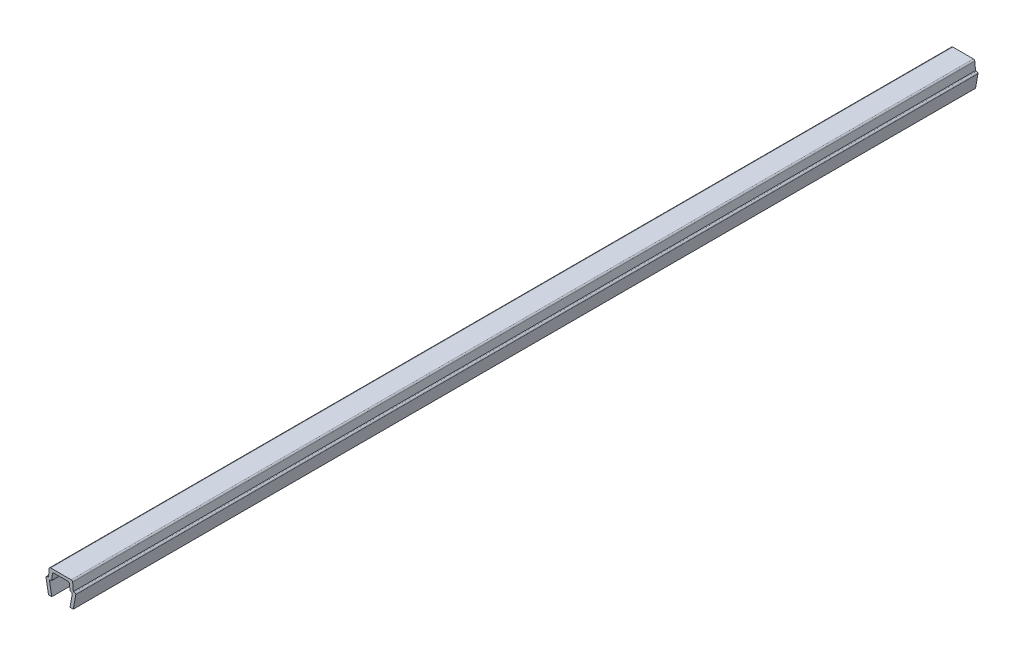
ISO-10303-21;
HEADER;
FILE_DESCRIPTION(('STEP AP214'),'2;1');
FILE_NAME('part.step','',(''),(''),'','','');
FILE_SCHEMA(('AUTOMOTIVE_DESIGN { 1 0 10303 214 1 1 1 1 }'));
ENDSEC;
DATA;
#1=APPLICATION_CONTEXT('core data for automotive mechanical design processes');
#2=APPLICATION_PROTOCOL_DEFINITION('international standard','automotive_design',2000,#1);
#3=PRODUCT_CONTEXT('',#1,'mechanical');
#4=PRODUCT('Part','Part','',(#3));
#5=PRODUCT_RELATED_PRODUCT_CATEGORY('part','',(#4));
#6=PRODUCT_DEFINITION_FORMATION('','',#4);
#7=PRODUCT_DEFINITION_CONTEXT('part definition',#1,'design');
#8=PRODUCT_DEFINITION('design','',#6,#7);
#9=PRODUCT_DEFINITION_SHAPE('','',#8);
#10=(LENGTH_UNIT() NAMED_UNIT(*) SI_UNIT(.MILLI.,.METRE.));
#11=(NAMED_UNIT(*) PLANE_ANGLE_UNIT() SI_UNIT($,.RADIAN.));
#12=(NAMED_UNIT(*) SI_UNIT($,.STERADIAN.) SOLID_ANGLE_UNIT());
#13=UNCERTAINTY_MEASURE_WITH_UNIT(LENGTH_MEASURE(1.E-05),#10,'distance_accuracy_value','');
#14=(GEOMETRIC_REPRESENTATION_CONTEXT(3) GLOBAL_UNCERTAINTY_ASSIGNED_CONTEXT((#13)) GLOBAL_UNIT_ASSIGNED_CONTEXT((#10,
#11,#12)) REPRESENTATION_CONTEXT('',''));
#15=CARTESIAN_POINT('',(0.,0.,0.));
#16=DIRECTION('',(0.,0.,1.));
#17=DIRECTION('',(1.,0.,0.));
#18=AXIS2_PLACEMENT_3D('',#15,#16,#17);
#19=CARTESIAN_POINT('',(-3.25000000000003,3.35000000000003,109.));
#20=DIRECTION('',(0.,0.,-1.));
#21=DIRECTION('',(-1.,0.,0.));
#22=AXIS2_PLACEMENT_3D('',#19,#20,#21);
#23=CYLINDRICAL_SURFACE('',#22,0.349999999999972);
#24=DIRECTION('',(0.,0.,-1.));
#25=VECTOR('',#24,1.);
#26=CARTESIAN_POINT('',(-3.25,3.7,109.));
#27=LINE('',#26,#25);
#28=CARTESIAN_POINT('',(-3.25,3.7,109.));
#29=VERTEX_POINT('',#28);
#30=CARTESIAN_POINT('',(-3.25,3.7,-109.));
#31=VERTEX_POINT('',#30);
#32=EDGE_CURVE('E211',#29,#31,#27,.T.);
#33=ORIENTED_EDGE('',*,*,#32,.T.);
#34=CARTESIAN_POINT('',(-3.25000000000003,3.35000000000003,-109.));
#35=DIRECTION('',(0.,0.,1.));
#36=DIRECTION('',(1.,0.,0.));
#37=AXIS2_PLACEMENT_3D('',#34,#35,#36);
#38=CIRCLE('',#37,0.349999999999972);
#39=CARTESIAN_POINT('',(-3.6,3.35,-109.));
#40=VERTEX_POINT('',#39);
#41=EDGE_CURVE('E205',#31,#40,#38,.T.);
#42=ORIENTED_EDGE('',*,*,#41,.T.);
#43=DIRECTION('',(0.,0.,-1.));
#44=VECTOR('',#43,1.);
#45=CARTESIAN_POINT('',(-3.6,3.35,109.));
#46=LINE('',#45,#44);
#47=CARTESIAN_POINT('',(-3.6,3.35,109.));
#48=VERTEX_POINT('',#47);
#49=EDGE_CURVE('E11',#48,#40,#46,.T.);
#50=ORIENTED_EDGE('',*,*,#49,.F.);
#51=CARTESIAN_POINT('',(-3.25000000000003,3.35000000000003,109.));
#52=DIRECTION('',(0.,0.,1.));
#53=DIRECTION('',(1.,0.,0.));
#54=AXIS2_PLACEMENT_3D('',#51,#52,#53);
#55=CIRCLE('',#54,0.349999999999972);
#56=EDGE_CURVE('E277',#29,#48,#55,.T.);
#57=ORIENTED_EDGE('',*,*,#56,.F.);
#58=EDGE_LOOP('',(#33,#42,#50,#57));
#59=FACE_BOUND('',#58,.T.);
#60=ADVANCED_FACE('F33',(#59),#23,.T.);
#61=CARTESIAN_POINT('',(-3.6,3.35,109.));
#62=DIRECTION('',(0.984336643247304,0.176299100283099,0.));
#63=DIRECTION('',(-0.176299100283099,0.984336643247304,0.));
#64=AXIS2_PLACEMENT_3D('',#61,#62,#63);
#65=PLANE('',#64);
#66=ORIENTED_EDGE('',*,*,#49,.T.);
#67=DIRECTION('',(0.176299100283099,-0.984336643247304,0.));
#68=VECTOR('',#67,1.);
#69=CARTESIAN_POINT('',(-3.6,3.35,-109.));
#70=LINE('',#69,#68);
#71=CARTESIAN_POINT('',(-3.,0.,-109.));
#72=VERTEX_POINT('',#71);
#73=EDGE_CURVE('E195',#40,#72,#70,.T.);
#74=ORIENTED_EDGE('',*,*,#73,.T.);
#75=DIRECTION('',(0.,0.,-1.));
#76=VECTOR('',#75,1.);
#77=CARTESIAN_POINT('',(-3.,0.,109.));
#78=LINE('',#77,#76);
#79=CARTESIAN_POINT('',(-3.,0.,109.));
#80=VERTEX_POINT('',#79);
#81=EDGE_CURVE('E40',#80,#72,#78,.T.);
#82=ORIENTED_EDGE('',*,*,#81,.F.);
#83=DIRECTION('',(0.176299100283099,-0.984336643247304,0.));
#84=VECTOR('',#83,1.);
#85=CARTESIAN_POINT('',(-3.6,3.35,109.));
#86=LINE('',#85,#84);
#87=EDGE_CURVE('E196',#48,#80,#86,.T.);
#88=ORIENTED_EDGE('',*,*,#87,.F.);
#89=EDGE_LOOP('',(#66,#74,#82,#88));
#90=FACE_BOUND('',#89,.T.);
#91=ADVANCED_FACE('F193',(#90),#65,.F.);
#92=CARTESIAN_POINT('',(-3.,0.,109.));
#93=DIRECTION('',(0.,1.,0.));
#94=DIRECTION('',(0.,0.,1.));
#95=AXIS2_PLACEMENT_3D('',#92,#93,#94);
#96=PLANE('',#95);
#97=ORIENTED_EDGE('',*,*,#81,.T.);
#98=DIRECTION('',(1.,0.,0.));
#99=VECTOR('',#98,1.);
#100=CARTESIAN_POINT('',(-3.,0.,-109.));
#101=LINE('',#100,#99);
#102=CARTESIAN_POINT('',(-2.2,0.,-109.));
#103=VERTEX_POINT('',#102);
#104=EDGE_CURVE('E209',#72,#103,#101,.T.);
#105=ORIENTED_EDGE('',*,*,#104,.T.);
#106=DIRECTION('',(0.,0.,-1.));
#107=VECTOR('',#106,1.);
#108=CARTESIAN_POINT('',(-2.2,0.,109.));
#109=LINE('',#108,#107);
#110=CARTESIAN_POINT('',(-2.2,0.,109.));
#111=VERTEX_POINT('',#110);
#112=EDGE_CURVE('E363',#111,#103,#109,.T.);
#113=ORIENTED_EDGE('',*,*,#112,.F.);
#114=DIRECTION('',(1.,0.,0.));
#115=VECTOR('',#114,1.);
#116=CARTESIAN_POINT('',(-3.,0.,109.));
#117=LINE('',#116,#115);
#118=EDGE_CURVE('E280',#80,#111,#117,.T.);
#119=ORIENTED_EDGE('',*,*,#118,.F.);
#120=EDGE_LOOP('',(#97,#105,#113,#119));
#121=FACE_BOUND('',#120,.T.);
#122=ADVANCED_FACE('F366',(#121),#96,.F.);
#123=CARTESIAN_POINT('',(-2.2,0.,109.));
#124=DIRECTION('',(-0.984336643247306,-0.176299100283088,0.));
#125=DIRECTION('',(0.176299100283088,-0.984336643247306,0.));
#126=AXIS2_PLACEMENT_3D('',#123,#124,#125);
#127=PLANE('',#126);
#128=ORIENTED_EDGE('',*,*,#112,.T.);
#129=DIRECTION('',(-0.176299100283088,0.984336643247306,0.));
#130=VECTOR('',#129,1.);
#131=CARTESIAN_POINT('',(-2.2,0.,-109.));
#132=LINE('',#131,#130);
#133=CARTESIAN_POINT('',(-2.7352170713255,2.9882953149009,-109.));
#134=VERTEX_POINT('',#133);
#135=EDGE_CURVE('E215',#103,#134,#132,.T.);
#136=ORIENTED_EDGE('',*,*,#135,.T.);
#137=DIRECTION('',(0.,0.,-1.));
#138=VECTOR('',#137,1.);
#139=CARTESIAN_POINT('',(-2.7352170713255,2.9882953149009,109.));
#140=LINE('',#139,#138);
#141=CARTESIAN_POINT('',(-2.7352170713255,2.9882953149009,109.));
#142=VERTEX_POINT('',#141);
#143=EDGE_CURVE('E361',#142,#134,#140,.T.);
#144=ORIENTED_EDGE('',*,*,#143,.F.);
#145=DIRECTION('',(-0.176299100283088,0.984336643247306,0.));
#146=VECTOR('',#145,1.);
#147=CARTESIAN_POINT('',(-2.2,0.,109.));
#148=LINE('',#147,#146);
#149=EDGE_CURVE('E282',#111,#142,#148,.T.);
#150=ORIENTED_EDGE('',*,*,#149,.F.);
#151=EDGE_LOOP('',(#128,#136,#144,#150));
#152=FACE_BOUND('',#151,.T.);
#153=ADVANCED_FACE('F374',(#152),#127,.F.);
#154=CARTESIAN_POINT('',(-2.390699246189,3.05000000000004,109.));
#155=DIRECTION('',(0.,0.,-1.));
#156=DIRECTION('',(-1.,0.,0.));
#157=AXIS2_PLACEMENT_3D('',#154,#155,#156);
#158=CYLINDRICAL_SURFACE('',#157,0.349999999999955);
#159=ORIENTED_EDGE('',*,*,#143,.T.);
#160=CARTESIAN_POINT('',(-2.390699246189,3.05000000000004,-109.));
#161=DIRECTION('',(0.,0.,-1.));
#162=DIRECTION('',(-1.,0.,0.));
#163=AXIS2_PLACEMENT_3D('',#160,#161,#162);
#164=CIRCLE('',#163,0.349999999999955);
#165=CARTESIAN_POINT('',(-2.390699246189,3.4,-109.));
#166=VERTEX_POINT('',#165);
#167=EDGE_CURVE('E218',#134,#166,#164,.T.);
#168=ORIENTED_EDGE('',*,*,#167,.T.);
#169=DIRECTION('',(0.,0.,-1.));
#170=VECTOR('',#169,1.);
#171=CARTESIAN_POINT('',(-2.390699246189,3.4,109.));
#172=LINE('',#171,#170);
#173=CARTESIAN_POINT('',(-2.390699246189,3.4,109.));
#174=VERTEX_POINT('',#173);
#175=EDGE_CURVE('E359',#174,#166,#172,.T.);
#176=ORIENTED_EDGE('',*,*,#175,.F.);
#177=CARTESIAN_POINT('',(-2.390699246189,3.05000000000004,109.));
#178=DIRECTION('',(0.,0.,-1.));
#179=DIRECTION('',(-1.,0.,0.));
#180=AXIS2_PLACEMENT_3D('',#177,#178,#179);
#181=CIRCLE('',#180,0.349999999999955);
#182=EDGE_CURVE('E284',#142,#174,#181,.T.);
#183=ORIENTED_EDGE('',*,*,#182,.F.);
#184=EDGE_LOOP('',(#159,#168,#176,#183));
#185=FACE_BOUND('',#184,.T.);
#186=ADVANCED_FACE('F377',(#185),#158,.F.);
#187=CARTESIAN_POINT('',(-2.390699246189,3.4,109.));
#188=DIRECTION('',(0.,1.,0.));
#189=DIRECTION('',(0.,0.,1.));
#190=AXIS2_PLACEMENT_3D('',#187,#188,#189);
#191=PLANE('',#190);
#192=ORIENTED_EDGE('',*,*,#175,.T.);
#193=DIRECTION('',(1.,0.,0.));
#194=VECTOR('',#193,1.);
#195=CARTESIAN_POINT('',(-2.390699246189,3.4,-109.));
#196=LINE('',#195,#194);
#197=CARTESIAN_POINT('',(-2.2,3.4,-109.));
#198=VERTEX_POINT('',#197);
#199=EDGE_CURVE('E221',#166,#198,#196,.T.);
#200=ORIENTED_EDGE('',*,*,#199,.T.);
#201=DIRECTION('',(0.,0.,-1.));
#202=VECTOR('',#201,1.);
#203=CARTESIAN_POINT('',(-2.2,3.4,109.));
#204=LINE('',#203,#202);
#205=CARTESIAN_POINT('',(-2.2,3.4,109.));
#206=VERTEX_POINT('',#205);
#207=EDGE_CURVE('E357',#206,#198,#204,.T.);
#208=ORIENTED_EDGE('',*,*,#207,.F.);
#209=DIRECTION('',(1.,0.,0.));
#210=VECTOR('',#209,1.);
#211=CARTESIAN_POINT('',(-2.390699246189,3.4,109.));
#212=LINE('',#211,#210);
#213=EDGE_CURVE('E286',#174,#206,#212,.T.);
#214=ORIENTED_EDGE('',*,*,#213,.F.);
#215=EDGE_LOOP('',(#192,#200,#208,#214));
#216=FACE_BOUND('',#215,.T.);
#217=ADVANCED_FACE('F382',(#216),#191,.F.);
#218=CARTESIAN_POINT('',(-2.2,3.4,109.));
#219=DIRECTION('',(-0.996194698091743,0.08715574274769,0.));
#220=DIRECTION('',(-0.08715574274769,-0.996194698091743,0.));
#221=AXIS2_PLACEMENT_3D('',#218,#219,#220);
#222=PLANE('',#221);
#223=ORIENTED_EDGE('',*,*,#207,.T.);
#224=DIRECTION('',(0.08715574274769,0.996194698091743,0.));
#225=VECTOR('',#224,1.);
#226=CARTESIAN_POINT('',(-2.2,3.4,-109.));
#227=LINE('',#226,#225);
#228=CARTESIAN_POINT('',(-2.0704726390793,4.8805045099617,-109.));
#229=VERTEX_POINT('',#228);
#230=EDGE_CURVE('E224',#198,#229,#227,.T.);
#231=ORIENTED_EDGE('',*,*,#230,.T.);
#232=DIRECTION('',(0.,0.,-1.));
#233=VECTOR('',#232,1.);
#234=CARTESIAN_POINT('',(-2.0704726390793,4.8805045099617,109.));
#235=LINE('',#234,#233);
#236=CARTESIAN_POINT('',(-2.0704726390793,4.8805045099617,109.));
#237=VERTEX_POINT('',#236);
#238=EDGE_CURVE('E355',#237,#229,#235,.T.);
#239=ORIENTED_EDGE('',*,*,#238,.F.);
#240=DIRECTION('',(0.08715574274769,0.996194698091743,0.));
#241=VECTOR('',#240,1.);
#242=CARTESIAN_POINT('',(-2.2,3.4,109.));
#243=LINE('',#242,#241);
#244=EDGE_CURVE('E288',#206,#237,#243,.T.);
#245=ORIENTED_EDGE('',*,*,#244,.F.);
#246=EDGE_LOOP('',(#223,#231,#239,#245));
#247=FACE_BOUND('',#246,.T.);
#248=ADVANCED_FACE('F388',(#247),#222,.F.);
#249=CARTESIAN_POINT('',(-1.72180449474716,4.84999999999996,109.));
#250=DIRECTION('',(0.,0.,-1.));
#251=DIRECTION('',(-1.,0.,0.));
#252=AXIS2_PLACEMENT_3D('',#249,#250,#251);
#253=CYLINDRICAL_SURFACE('',#252,0.350000000000036);
#254=ORIENTED_EDGE('',*,*,#238,.T.);
#255=CARTESIAN_POINT('',(-1.72180449474716,4.84999999999996,-109.));
#256=DIRECTION('',(0.,0.,-1.));
#257=DIRECTION('',(-1.,0.,0.));
#258=AXIS2_PLACEMENT_3D('',#255,#256,#257);
#259=CIRCLE('',#258,0.350000000000036);
#260=CARTESIAN_POINT('',(-1.7218044947472,5.2,-109.));
#261=VERTEX_POINT('',#260);
#262=EDGE_CURVE('E227',#229,#261,#259,.T.);
#263=ORIENTED_EDGE('',*,*,#262,.T.);
#264=DIRECTION('',(0.,0.,-1.));
#265=VECTOR('',#264,1.);
#266=CARTESIAN_POINT('',(-1.7218044947472,5.2,109.));
#267=LINE('',#266,#265);
#268=CARTESIAN_POINT('',(-1.7218044947472,5.2,109.));
#269=VERTEX_POINT('',#268);
#270=EDGE_CURVE('E353',#269,#261,#267,.T.);
#271=ORIENTED_EDGE('',*,*,#270,.F.);
#272=CARTESIAN_POINT('',(-1.72180449474716,4.84999999999996,109.));
#273=DIRECTION('',(0.,0.,-1.));
#274=DIRECTION('',(-1.,0.,0.));
#275=AXIS2_PLACEMENT_3D('',#272,#273,#274);
#276=CIRCLE('',#275,0.350000000000036);
#277=EDGE_CURVE('E290',#237,#269,#276,.T.);
#278=ORIENTED_EDGE('',*,*,#277,.F.);
#279=EDGE_LOOP('',(#254,#263,#271,#278));
#280=FACE_BOUND('',#279,.T.);
#281=ADVANCED_FACE('F392',(#280),#253,.F.);
#282=CARTESIAN_POINT('',(-1.7218044947472,5.2,109.));
#283=DIRECTION('',(0.,1.,0.));
#284=DIRECTION('',(0.,0.,1.));
#285=AXIS2_PLACEMENT_3D('',#282,#283,#284);
#286=PLANE('',#285);
#287=ORIENTED_EDGE('',*,*,#270,.T.);
#288=DIRECTION('',(1.,0.,0.));
#289=VECTOR('',#288,1.);
#290=CARTESIAN_POINT('',(-1.7218044947472,5.2,-109.));
#291=LINE('',#290,#289);
#292=CARTESIAN_POINT('',(1.7218044947472,5.2,-109.));
#293=VERTEX_POINT('',#292);
#294=EDGE_CURVE('E230',#261,#293,#291,.T.);
#295=ORIENTED_EDGE('',*,*,#294,.T.);
#296=DIRECTION('',(0.,0.,-1.));
#297=VECTOR('',#296,1.);
#298=CARTESIAN_POINT('',(1.7218044947472,5.2,109.));
#299=LINE('',#298,#297);
#300=CARTESIAN_POINT('',(1.7218044947472,5.2,109.));
#301=VERTEX_POINT('',#300);
#302=EDGE_CURVE('E351',#301,#293,#299,.T.);
#303=ORIENTED_EDGE('',*,*,#302,.F.);
#304=DIRECTION('',(1.,0.,0.));
#305=VECTOR('',#304,1.);
#306=CARTESIAN_POINT('',(-1.7218044947472,5.2,109.));
#307=LINE('',#306,#305);
#308=EDGE_CURVE('E292',#269,#301,#307,.T.);
#309=ORIENTED_EDGE('',*,*,#308,.F.);
#310=EDGE_LOOP('',(#287,#295,#303,#309));
#311=FACE_BOUND('',#310,.T.);
#312=ADVANCED_FACE('F397',(#311),#286,.F.);
#313=CARTESIAN_POINT('',(1.72180449474716,4.84999999999996,109.));
#314=DIRECTION('',(0.,0.,-1.));
#315=DIRECTION('',(-1.,0.,0.));
#316=AXIS2_PLACEMENT_3D('',#313,#314,#315);
#317=CYLINDRICAL_SURFACE('',#316,0.350000000000036);
#318=ORIENTED_EDGE('',*,*,#302,.T.);
#319=CARTESIAN_POINT('',(1.72180449474716,4.84999999999996,-109.));
#320=DIRECTION('',(0.,0.,-1.));
#321=DIRECTION('',(-1.,0.,0.));
#322=AXIS2_PLACEMENT_3D('',#319,#320,#321);
#323=CIRCLE('',#322,0.350000000000036);
#324=CARTESIAN_POINT('',(2.0704726390793,4.8805045099617,-109.));
#325=VERTEX_POINT('',#324);
#326=EDGE_CURVE('E233',#293,#325,#323,.T.);
#327=ORIENTED_EDGE('',*,*,#326,.T.);
#328=DIRECTION('',(0.,0.,-1.));
#329=VECTOR('',#328,1.);
#330=CARTESIAN_POINT('',(2.0704726390793,4.8805045099617,109.));
#331=LINE('',#330,#329);
#332=CARTESIAN_POINT('',(2.0704726390793,4.8805045099617,109.));
#333=VERTEX_POINT('',#332);
#334=EDGE_CURVE('E349',#333,#325,#331,.T.);
#335=ORIENTED_EDGE('',*,*,#334,.F.);
#336=CARTESIAN_POINT('',(1.72180449474716,4.84999999999996,109.));
#337=DIRECTION('',(0.,0.,-1.));
#338=DIRECTION('',(-1.,0.,0.));
#339=AXIS2_PLACEMENT_3D('',#336,#337,#338);
#340=CIRCLE('',#339,0.350000000000036);
#341=EDGE_CURVE('E294',#301,#333,#340,.T.);
#342=ORIENTED_EDGE('',*,*,#341,.F.);
#343=EDGE_LOOP('',(#318,#327,#335,#342));
#344=FACE_BOUND('',#343,.T.);
#345=ADVANCED_FACE('F403',(#344),#317,.F.);
#346=CARTESIAN_POINT('',(2.0704726390793,4.8805045099617,109.));
#347=DIRECTION('',(0.996194698091743,0.08715574274769,0.));
#348=DIRECTION('',(-0.08715574274769,0.996194698091743,0.));
#349=AXIS2_PLACEMENT_3D('',#346,#347,#348);
#350=PLANE('',#349);
#351=ORIENTED_EDGE('',*,*,#334,.T.);
#352=DIRECTION('',(0.08715574274769,-0.996194698091743,0.));
#353=VECTOR('',#352,1.);
#354=CARTESIAN_POINT('',(2.0704726390793,4.8805045099617,-109.));
#355=LINE('',#354,#353);
#356=CARTESIAN_POINT('',(2.2,3.4,-109.));
#357=VERTEX_POINT('',#356);
#358=EDGE_CURVE('E236',#325,#357,#355,.T.);
#359=ORIENTED_EDGE('',*,*,#358,.T.);
#360=DIRECTION('',(0.,0.,-1.));
#361=VECTOR('',#360,1.);
#362=CARTESIAN_POINT('',(2.2,3.4,109.));
#363=LINE('',#362,#361);
#364=CARTESIAN_POINT('',(2.2,3.4,109.));
#365=VERTEX_POINT('',#364);
#366=EDGE_CURVE('E347',#365,#357,#363,.T.);
#367=ORIENTED_EDGE('',*,*,#366,.F.);
#368=DIRECTION('',(0.08715574274769,-0.996194698091743,0.));
#369=VECTOR('',#368,1.);
#370=CARTESIAN_POINT('',(2.0704726390793,4.8805045099617,109.));
#371=LINE('',#370,#369);
#372=EDGE_CURVE('E296',#333,#365,#371,.T.);
#373=ORIENTED_EDGE('',*,*,#372,.F.);
#374=EDGE_LOOP('',(#351,#359,#367,#373));
#375=FACE_BOUND('',#374,.T.);
#376=ADVANCED_FACE('F407',(#375),#350,.F.);
#377=CARTESIAN_POINT('',(2.2,3.4,109.));
#378=DIRECTION('',(0.,1.,0.));
#379=DIRECTION('',(0.,0.,1.));
#380=AXIS2_PLACEMENT_3D('',#377,#378,#379);
#381=PLANE('',#380);
#382=ORIENTED_EDGE('',*,*,#366,.T.);
#383=DIRECTION('',(1.,0.,0.));
#384=VECTOR('',#383,1.);
#385=CARTESIAN_POINT('',(2.2,3.4,-109.));
#386=LINE('',#385,#384);
#387=CARTESIAN_POINT('',(2.390699246189,3.4,-109.));
#388=VERTEX_POINT('',#387);
#389=EDGE_CURVE('E239',#357,#388,#386,.T.);
#390=ORIENTED_EDGE('',*,*,#389,.T.);
#391=DIRECTION('',(0.,0.,-1.));
#392=VECTOR('',#391,1.);
#393=CARTESIAN_POINT('',(2.390699246189,3.4,109.));
#394=LINE('',#393,#392);
#395=CARTESIAN_POINT('',(2.390699246189,3.4,109.));
#396=VERTEX_POINT('',#395);
#397=EDGE_CURVE('E345',#396,#388,#394,.T.);
#398=ORIENTED_EDGE('',*,*,#397,.F.);
#399=DIRECTION('',(1.,0.,0.));
#400=VECTOR('',#399,1.);
#401=CARTESIAN_POINT('',(2.2,3.4,109.));
#402=LINE('',#401,#400);
#403=EDGE_CURVE('E298',#365,#396,#402,.T.);
#404=ORIENTED_EDGE('',*,*,#403,.F.);
#405=EDGE_LOOP('',(#382,#390,#398,#404));
#406=FACE_BOUND('',#405,.T.);
#407=ADVANCED_FACE('F412',(#406),#381,.F.);
#408=CARTESIAN_POINT('',(2.390699246189,3.05000000000004,109.));
#409=DIRECTION('',(0.,0.,-1.));
#410=DIRECTION('',(-1.,0.,0.));
#411=AXIS2_PLACEMENT_3D('',#408,#409,#410);
#412=CYLINDRICAL_SURFACE('',#411,0.349999999999955);
#413=ORIENTED_EDGE('',*,*,#397,.T.);
#414=CARTESIAN_POINT('',(2.390699246189,3.05000000000004,-109.));
#415=DIRECTION('',(0.,0.,-1.));
#416=DIRECTION('',(-1.,0.,0.));
#417=AXIS2_PLACEMENT_3D('',#414,#415,#416);
#418=CIRCLE('',#417,0.349999999999955);
#419=CARTESIAN_POINT('',(2.7352170713255,2.9882953149009,-109.));
#420=VERTEX_POINT('',#419);
#421=EDGE_CURVE('E242',#388,#420,#418,.T.);
#422=ORIENTED_EDGE('',*,*,#421,.T.);
#423=DIRECTION('',(0.,0.,-1.));
#424=VECTOR('',#423,1.);
#425=CARTESIAN_POINT('',(2.7352170713255,2.9882953149009,109.));
#426=LINE('',#425,#424);
#427=CARTESIAN_POINT('',(2.7352170713255,2.9882953149009,109.));
#428=VERTEX_POINT('',#427);
#429=EDGE_CURVE('E343',#428,#420,#426,.T.);
#430=ORIENTED_EDGE('',*,*,#429,.F.);
#431=CARTESIAN_POINT('',(2.390699246189,3.05000000000004,109.));
#432=DIRECTION('',(0.,0.,-1.));
#433=DIRECTION('',(-1.,0.,0.));
#434=AXIS2_PLACEMENT_3D('',#431,#432,#433);
#435=CIRCLE('',#434,0.349999999999955);
#436=EDGE_CURVE('E300',#396,#428,#435,.T.);
#437=ORIENTED_EDGE('',*,*,#436,.F.);
#438=EDGE_LOOP('',(#413,#422,#430,#437));
#439=FACE_BOUND('',#438,.T.);
#440=ADVANCED_FACE('F418',(#439),#412,.F.);
#441=CARTESIAN_POINT('',(2.7352170713255,2.9882953149009,109.));
#442=DIRECTION('',(0.984336643247306,-0.176299100283088,0.));
#443=DIRECTION('',(0.176299100283088,0.984336643247306,0.));
#444=AXIS2_PLACEMENT_3D('',#441,#442,#443);
#445=PLANE('',#444);
#446=ORIENTED_EDGE('',*,*,#429,.T.);
#447=DIRECTION('',(-0.176299100283088,-0.984336643247306,0.));
#448=VECTOR('',#447,1.);
#449=CARTESIAN_POINT('',(2.7352170713255,2.9882953149009,-109.));
#450=LINE('',#449,#448);
#451=CARTESIAN_POINT('',(2.2,0.,-109.));
#452=VERTEX_POINT('',#451);
#453=EDGE_CURVE('E245',#420,#452,#450,.T.);
#454=ORIENTED_EDGE('',*,*,#453,.T.);
#455=DIRECTION('',(0.,0.,-1.));
#456=VECTOR('',#455,1.);
#457=CARTESIAN_POINT('',(2.2,0.,109.));
#458=LINE('',#457,#456);
#459=CARTESIAN_POINT('',(2.2,0.,109.));
#460=VERTEX_POINT('',#459);
#461=EDGE_CURVE('E341',#460,#452,#458,.T.);
#462=ORIENTED_EDGE('',*,*,#461,.F.);
#463=DIRECTION('',(-0.176299100283088,-0.984336643247306,0.));
#464=VECTOR('',#463,1.);
#465=CARTESIAN_POINT('',(2.7352170713255,2.9882953149009,109.));
#466=LINE('',#465,#464);
#467=EDGE_CURVE('E302',#428,#460,#466,.T.);
#468=ORIENTED_EDGE('',*,*,#467,.F.);
#469=EDGE_LOOP('',(#446,#454,#462,#468));
#470=FACE_BOUND('',#469,.T.);
#471=ADVANCED_FACE('F422',(#470),#445,.F.);
#472=CARTESIAN_POINT('',(2.2,0.,109.));
#473=DIRECTION('',(0.,1.,0.));
#474=DIRECTION('',(0.,0.,1.));
#475=AXIS2_PLACEMENT_3D('',#472,#473,#474);
#476=PLANE('',#475);
#477=ORIENTED_EDGE('',*,*,#461,.T.);
#478=DIRECTION('',(1.,0.,0.));
#479=VECTOR('',#478,1.);
#480=CARTESIAN_POINT('',(2.2,0.,-109.));
#481=LINE('',#480,#479);
#482=CARTESIAN_POINT('',(3.,0.,-109.));
#483=VERTEX_POINT('',#482);
#484=EDGE_CURVE('E248',#452,#483,#481,.T.);
#485=ORIENTED_EDGE('',*,*,#484,.T.);
#486=DIRECTION('',(0.,0.,-1.));
#487=VECTOR('',#486,1.);
#488=CARTESIAN_POINT('',(3.,0.,109.));
#489=LINE('',#488,#487);
#490=CARTESIAN_POINT('',(3.,0.,109.));
#491=VERTEX_POINT('',#490);
#492=EDGE_CURVE('E339',#491,#483,#489,.T.);
#493=ORIENTED_EDGE('',*,*,#492,.F.);
#494=DIRECTION('',(1.,0.,0.));
#495=VECTOR('',#494,1.);
#496=CARTESIAN_POINT('',(2.2,0.,109.));
#497=LINE('',#496,#495);
#498=EDGE_CURVE('E304',#460,#491,#497,.T.);
#499=ORIENTED_EDGE('',*,*,#498,.F.);
#500=EDGE_LOOP('',(#477,#485,#493,#499));
#501=FACE_BOUND('',#500,.T.);
#502=ADVANCED_FACE('F427',(#501),#476,.F.);
#503=CARTESIAN_POINT('',(3.,0.,109.));
#504=DIRECTION('',(-0.984336643247304,0.176299100283099,0.));
#505=DIRECTION('',(-0.176299100283099,-0.984336643247304,0.));
#506=AXIS2_PLACEMENT_3D('',#503,#504,#505);
#507=PLANE('',#506);
#508=ORIENTED_EDGE('',*,*,#492,.T.);
#509=DIRECTION('',(0.176299100283099,0.984336643247304,0.));
#510=VECTOR('',#509,1.);
#511=CARTESIAN_POINT('',(3.,0.,-109.));
#512=LINE('',#511,#510);
#513=CARTESIAN_POINT('',(3.6,3.35,-109.));
#514=VERTEX_POINT('',#513);
#515=EDGE_CURVE('E251',#483,#514,#512,.T.);
#516=ORIENTED_EDGE('',*,*,#515,.T.);
#517=DIRECTION('',(0.,0.,-1.));
#518=VECTOR('',#517,1.);
#519=CARTESIAN_POINT('',(3.6,3.35,109.));
#520=LINE('',#519,#518);
#521=CARTESIAN_POINT('',(3.6,3.35,109.));
#522=VERTEX_POINT('',#521);
#523=EDGE_CURVE('E337',#522,#514,#520,.T.);
#524=ORIENTED_EDGE('',*,*,#523,.F.);
#525=DIRECTION('',(0.176299100283099,0.984336643247304,0.));
#526=VECTOR('',#525,1.);
#527=CARTESIAN_POINT('',(3.,0.,109.));
#528=LINE('',#527,#526);
#529=EDGE_CURVE('E306',#491,#522,#528,.T.);
#530=ORIENTED_EDGE('',*,*,#529,.F.);
#531=EDGE_LOOP('',(#508,#516,#524,#530));
#532=FACE_BOUND('',#531,.T.);
#533=ADVANCED_FACE('F433',(#532),#507,.F.);
#534=CARTESIAN_POINT('',(3.25000000000003,3.35000000000003,109.));
#535=DIRECTION('',(0.,0.,-1.));
#536=DIRECTION('',(-1.,0.,0.));
#537=AXIS2_PLACEMENT_3D('',#534,#535,#536);
#538=CYLINDRICAL_SURFACE('',#537,0.349999999999972);
#539=ORIENTED_EDGE('',*,*,#523,.T.);
#540=CARTESIAN_POINT('',(3.25000000000003,3.35000000000003,-109.));
#541=DIRECTION('',(0.,0.,1.));
#542=DIRECTION('',(1.,0.,0.));
#543=AXIS2_PLACEMENT_3D('',#540,#541,#542);
#544=CIRCLE('',#543,0.349999999999972);
#545=CARTESIAN_POINT('',(3.25,3.7,-109.));
#546=VERTEX_POINT('',#545);
#547=EDGE_CURVE('E254',#514,#546,#544,.T.);
#548=ORIENTED_EDGE('',*,*,#547,.T.);
#549=DIRECTION('',(0.,0.,-1.));
#550=VECTOR('',#549,1.);
#551=CARTESIAN_POINT('',(3.25,3.7,109.));
#552=LINE('',#551,#550);
#553=CARTESIAN_POINT('',(3.25,3.7,109.));
#554=VERTEX_POINT('',#553);
#555=EDGE_CURVE('E335',#554,#546,#552,.T.);
#556=ORIENTED_EDGE('',*,*,#555,.F.);
#557=CARTESIAN_POINT('',(3.25000000000003,3.35000000000003,109.));
#558=DIRECTION('',(0.,0.,1.));
#559=DIRECTION('',(1.,0.,0.));
#560=AXIS2_PLACEMENT_3D('',#557,#558,#559);
#561=CIRCLE('',#560,0.349999999999972);
#562=EDGE_CURVE('E308',#522,#554,#561,.T.);
#563=ORIENTED_EDGE('',*,*,#562,.F.);
#564=EDGE_LOOP('',(#539,#548,#556,#563));
#565=FACE_BOUND('',#564,.T.);
#566=ADVANCED_FACE('F437',(#565),#538,.T.);
#567=CARTESIAN_POINT('',(3.25,3.7,109.));
#568=DIRECTION('',(0.,-1.,0.));
#569=DIRECTION('',(0.,0.,-1.));
#570=AXIS2_PLACEMENT_3D('',#567,#568,#569);
#571=PLANE('',#570);
#572=ORIENTED_EDGE('',*,*,#555,.T.);
#573=DIRECTION('',(-1.,0.,0.));
#574=VECTOR('',#573,1.);
#575=CARTESIAN_POINT('',(3.25,3.7,-109.));
#576=LINE('',#575,#574);
#577=CARTESIAN_POINT('',(3.,3.7,-109.));
#578=VERTEX_POINT('',#577);
#579=EDGE_CURVE('E257',#546,#578,#576,.T.);
#580=ORIENTED_EDGE('',*,*,#579,.T.);
#581=DIRECTION('',(0.,0.,-1.));
#582=VECTOR('',#581,1.);
#583=CARTESIAN_POINT('',(3.,3.7,109.));
#584=LINE('',#583,#582);
#585=CARTESIAN_POINT('',(3.,3.7,109.));
#586=VERTEX_POINT('',#585);
#587=EDGE_CURVE('E333',#586,#578,#584,.T.);
#588=ORIENTED_EDGE('',*,*,#587,.F.);
#589=DIRECTION('',(-1.,0.,0.));
#590=VECTOR('',#589,1.);
#591=CARTESIAN_POINT('',(3.25,3.7,109.));
#592=LINE('',#591,#590);
#593=EDGE_CURVE('E310',#554,#586,#592,.T.);
#594=ORIENTED_EDGE('',*,*,#593,.F.);
#595=EDGE_LOOP('',(#572,#580,#588,#594));
#596=FACE_BOUND('',#595,.T.);
#597=ADVANCED_FACE('F442',(#596),#571,.F.);
#598=CARTESIAN_POINT('',(3.,3.7,109.));
#599=DIRECTION('',(-0.996194698091747,-0.0871557427476468,0.));
#600=DIRECTION('',(0.0871557427476468,-0.996194698091747,0.));
#601=AXIS2_PLACEMENT_3D('',#598,#599,#600);
#602=PLANE('',#601);
#603=ORIENTED_EDGE('',*,*,#587,.T.);
#604=DIRECTION('',(-0.0871557427476467,0.996194698091747,0.));
#605=VECTOR('',#604,1.);
#606=CARTESIAN_POINT('',(3.,3.7,-109.));
#607=LINE('',#606,#605);
#608=CARTESIAN_POINT('',(2.835477173669,5.5805045099617,-109.));
#609=VERTEX_POINT('',#608);
#610=EDGE_CURVE('E260',#578,#609,#607,.T.);
#611=ORIENTED_EDGE('',*,*,#610,.T.);
#612=DIRECTION('',(0.,0.,-1.));
#613=VECTOR('',#612,1.);
#614=CARTESIAN_POINT('',(2.835477173669,5.5805045099617,109.));
#615=LINE('',#614,#613);
#616=CARTESIAN_POINT('',(2.835477173669,5.5805045099617,109.));
#617=VERTEX_POINT('',#616);
#618=EDGE_CURVE('E331',#617,#609,#615,.T.);
#619=ORIENTED_EDGE('',*,*,#618,.F.);
#620=DIRECTION('',(-0.0871557427476467,0.996194698091747,0.));
#621=VECTOR('',#620,1.);
#622=CARTESIAN_POINT('',(3.,3.7,109.));
#623=LINE('',#622,#621);
#624=EDGE_CURVE('E312',#586,#617,#623,.T.);
#625=ORIENTED_EDGE('',*,*,#624,.F.);
#626=EDGE_LOOP('',(#603,#611,#619,#625));
#627=FACE_BOUND('',#626,.T.);
#628=ADVANCED_FACE('F448',(#627),#602,.F.);
#629=CARTESIAN_POINT('',(2.48680902933686,5.54999999999996,109.));
#630=DIRECTION('',(0.,0.,-1.));
#631=DIRECTION('',(-1.,0.,0.));
#632=AXIS2_PLACEMENT_3D('',#629,#630,#631);
#633=CYLINDRICAL_SURFACE('',#632,0.350000000000036);
#634=ORIENTED_EDGE('',*,*,#618,.T.);
#635=CARTESIAN_POINT('',(2.48680902933686,5.54999999999996,-109.));
#636=DIRECTION('',(0.,0.,1.));
#637=DIRECTION('',(1.,0.,0.));
#638=AXIS2_PLACEMENT_3D('',#635,#636,#637);
#639=CIRCLE('',#638,0.350000000000036);
#640=CARTESIAN_POINT('',(2.4868090293369,5.9,-109.));
#641=VERTEX_POINT('',#640);
#642=EDGE_CURVE('E263',#609,#641,#639,.T.);
#643=ORIENTED_EDGE('',*,*,#642,.T.);
#644=DIRECTION('',(0.,0.,-1.));
#645=VECTOR('',#644,1.);
#646=CARTESIAN_POINT('',(2.4868090293369,5.9,109.));
#647=LINE('',#646,#645);
#648=CARTESIAN_POINT('',(2.4868090293369,5.9,109.));
#649=VERTEX_POINT('',#648);
#650=EDGE_CURVE('E329',#649,#641,#647,.T.);
#651=ORIENTED_EDGE('',*,*,#650,.F.);
#652=CARTESIAN_POINT('',(2.48680902933686,5.54999999999996,109.));
#653=DIRECTION('',(0.,0.,1.));
#654=DIRECTION('',(1.,0.,0.));
#655=AXIS2_PLACEMENT_3D('',#652,#653,#654);
#656=CIRCLE('',#655,0.350000000000036);
#657=EDGE_CURVE('E314',#617,#649,#656,.T.);
#658=ORIENTED_EDGE('',*,*,#657,.F.);
#659=EDGE_LOOP('',(#634,#643,#651,#658));
#660=FACE_BOUND('',#659,.T.);
#661=ADVANCED_FACE('F452',(#660),#633,.T.);
#662=CARTESIAN_POINT('',(2.4868090293369,5.9,109.));
#663=DIRECTION('',(0.,-1.,0.));
#664=DIRECTION('',(0.,0.,-1.));
#665=AXIS2_PLACEMENT_3D('',#662,#663,#664);
#666=PLANE('',#665);
#667=ORIENTED_EDGE('',*,*,#650,.T.);
#668=DIRECTION('',(-1.,0.,0.));
#669=VECTOR('',#668,1.);
#670=CARTESIAN_POINT('',(2.4868090293369,5.9,-109.));
#671=LINE('',#670,#669);
#672=CARTESIAN_POINT('',(-2.4868090293369,5.9,-109.));
#673=VERTEX_POINT('',#672);
#674=EDGE_CURVE('E266',#641,#673,#671,.T.);
#675=ORIENTED_EDGE('',*,*,#674,.T.);
#676=DIRECTION('',(0.,0.,-1.));
#677=VECTOR('',#676,1.);
#678=CARTESIAN_POINT('',(-2.4868090293369,5.9,109.));
#679=LINE('',#678,#677);
#680=CARTESIAN_POINT('',(-2.4868090293369,5.9,109.));
#681=VERTEX_POINT('',#680);
#682=EDGE_CURVE('E327',#681,#673,#679,.T.);
#683=ORIENTED_EDGE('',*,*,#682,.F.);
#684=DIRECTION('',(-1.,0.,0.));
#685=VECTOR('',#684,1.);
#686=CARTESIAN_POINT('',(2.4868090293369,5.9,109.));
#687=LINE('',#686,#685);
#688=EDGE_CURVE('E316',#649,#681,#687,.T.);
#689=ORIENTED_EDGE('',*,*,#688,.F.);
#690=EDGE_LOOP('',(#667,#675,#683,#689));
#691=FACE_BOUND('',#690,.T.);
#692=ADVANCED_FACE('F457',(#691),#666,.F.);
#693=CARTESIAN_POINT('',(-2.48680902933686,5.54999999999996,109.));
#694=DIRECTION('',(0.,0.,-1.));
#695=DIRECTION('',(-1.,0.,0.));
#696=AXIS2_PLACEMENT_3D('',#693,#694,#695);
#697=CYLINDRICAL_SURFACE('',#696,0.350000000000036);
#698=ORIENTED_EDGE('',*,*,#682,.T.);
#699=CARTESIAN_POINT('',(-2.48680902933686,5.54999999999996,-109.));
#700=DIRECTION('',(0.,0.,1.));
#701=DIRECTION('',(1.,0.,0.));
#702=AXIS2_PLACEMENT_3D('',#699,#700,#701);
#703=CIRCLE('',#702,0.350000000000036);
#704=CARTESIAN_POINT('',(-2.835477173669,5.5805045099617,-109.));
#705=VERTEX_POINT('',#704);
#706=EDGE_CURVE('E269',#673,#705,#703,.T.);
#707=ORIENTED_EDGE('',*,*,#706,.T.);
#708=DIRECTION('',(0.,0.,-1.));
#709=VECTOR('',#708,1.);
#710=CARTESIAN_POINT('',(-2.835477173669,5.5805045099617,109.));
#711=LINE('',#710,#709);
#712=CARTESIAN_POINT('',(-2.835477173669,5.5805045099617,109.));
#713=VERTEX_POINT('',#712);
#714=EDGE_CURVE('E325',#713,#705,#711,.T.);
#715=ORIENTED_EDGE('',*,*,#714,.F.);
#716=CARTESIAN_POINT('',(-2.48680902933686,5.54999999999996,109.));
#717=DIRECTION('',(0.,0.,1.));
#718=DIRECTION('',(1.,0.,0.));
#719=AXIS2_PLACEMENT_3D('',#716,#717,#718);
#720=CIRCLE('',#719,0.350000000000036);
#721=EDGE_CURVE('E318',#681,#713,#720,.T.);
#722=ORIENTED_EDGE('',*,*,#721,.F.);
#723=EDGE_LOOP('',(#698,#707,#715,#722));
#724=FACE_BOUND('',#723,.T.);
#725=ADVANCED_FACE('F461',(#724),#697,.T.);
#726=CARTESIAN_POINT('',(-2.835477173669,5.5805045099617,109.));
#727=DIRECTION('',(0.996194698091747,-0.0871557427476468,0.));
#728=DIRECTION('',(0.0871557427476468,0.996194698091747,0.));
#729=AXIS2_PLACEMENT_3D('',#726,#727,#728);
#730=PLANE('',#729);
#731=ORIENTED_EDGE('',*,*,#714,.T.);
#732=DIRECTION('',(-0.0871557427476467,-0.996194698091747,0.));
#733=VECTOR('',#732,1.);
#734=CARTESIAN_POINT('',(-2.835477173669,5.5805045099617,-109.));
#735=LINE('',#734,#733);
#736=CARTESIAN_POINT('',(-3.,3.7,-109.));
#737=VERTEX_POINT('',#736);
#738=EDGE_CURVE('E272',#705,#737,#735,.T.);
#739=ORIENTED_EDGE('',*,*,#738,.T.);
#740=DIRECTION('',(0.,0.,-1.));
#741=VECTOR('',#740,1.);
#742=CARTESIAN_POINT('',(-3.,3.7,109.));
#743=LINE('',#742,#741);
#744=CARTESIAN_POINT('',(-3.,3.7,109.));
#745=VERTEX_POINT('',#744);
#746=EDGE_CURVE('E323',#745,#737,#743,.T.);
#747=ORIENTED_EDGE('',*,*,#746,.F.);
#748=DIRECTION('',(-0.0871557427476467,-0.996194698091747,0.));
#749=VECTOR('',#748,1.);
#750=CARTESIAN_POINT('',(-2.835477173669,5.5805045099617,109.));
#751=LINE('',#750,#749);
#752=EDGE_CURVE('E52',#713,#745,#751,.T.);
#753=ORIENTED_EDGE('',*,*,#752,.F.);
#754=EDGE_LOOP('',(#731,#739,#747,#753));
#755=FACE_BOUND('',#754,.T.);
#756=ADVANCED_FACE('F465',(#755),#730,.F.);
#757=CARTESIAN_POINT('',(-3.,3.7,109.));
#758=DIRECTION('',(0.,-1.,0.));
#759=DIRECTION('',(0.,0.,-1.));
#760=AXIS2_PLACEMENT_3D('',#757,#758,#759);
#761=PLANE('',#760);
#762=ORIENTED_EDGE('',*,*,#746,.T.);
#763=DIRECTION('',(-1.,0.,0.));
#764=VECTOR('',#763,1.);
#765=CARTESIAN_POINT('',(-3.,3.7,-109.));
#766=LINE('',#765,#764);
#767=EDGE_CURVE('E275',#737,#31,#766,.T.);
#768=ORIENTED_EDGE('',*,*,#767,.T.);
#769=ORIENTED_EDGE('',*,*,#32,.F.);
#770=DIRECTION('',(-1.,0.,0.));
#771=VECTOR('',#770,1.);
#772=CARTESIAN_POINT('',(-3.,3.7,109.));
#773=LINE('',#772,#771);
#774=EDGE_CURVE('E47',#745,#29,#773,.T.);
#775=ORIENTED_EDGE('',*,*,#774,.F.);
#776=EDGE_LOOP('',(#762,#768,#769,#775));
#777=FACE_BOUND('',#776,.T.);
#778=ADVANCED_FACE('F467',(#777),#761,.F.);
#779=CARTESIAN_POINT('',(-3.25000000000003,3.35000000000003,109.));
#780=DIRECTION('',(0.,0.,1.));
#781=DIRECTION('',(1.,0.,0.));
#782=AXIS2_PLACEMENT_3D('',#779,#780,#781);
#783=PLANE('',#782);
#784=ORIENTED_EDGE('',*,*,#56,.T.);
#785=ORIENTED_EDGE('',*,*,#87,.T.);
#786=ORIENTED_EDGE('',*,*,#118,.T.);
#787=ORIENTED_EDGE('',*,*,#149,.T.);
#788=ORIENTED_EDGE('',*,*,#182,.T.);
#789=ORIENTED_EDGE('',*,*,#213,.T.);
#790=ORIENTED_EDGE('',*,*,#244,.T.);
#791=ORIENTED_EDGE('',*,*,#277,.T.);
#792=ORIENTED_EDGE('',*,*,#308,.T.);
#793=ORIENTED_EDGE('',*,*,#341,.T.);
#794=ORIENTED_EDGE('',*,*,#372,.T.);
#795=ORIENTED_EDGE('',*,*,#403,.T.);
#796=ORIENTED_EDGE('',*,*,#436,.T.);
#797=ORIENTED_EDGE('',*,*,#467,.T.);
#798=ORIENTED_EDGE('',*,*,#498,.T.);
#799=ORIENTED_EDGE('',*,*,#529,.T.);
#800=ORIENTED_EDGE('',*,*,#562,.T.);
#801=ORIENTED_EDGE('',*,*,#593,.T.);
#802=ORIENTED_EDGE('',*,*,#624,.T.);
#803=ORIENTED_EDGE('',*,*,#657,.T.);
#804=ORIENTED_EDGE('',*,*,#688,.T.);
#805=ORIENTED_EDGE('',*,*,#721,.T.);
#806=ORIENTED_EDGE('',*,*,#752,.T.);
#807=ORIENTED_EDGE('',*,*,#774,.T.);
#808=EDGE_LOOP('',(#784,#785,#786,#787,#788,#789,#790,#791,#792,#793,#794,#795,#796,#797,#798,
#799,#800,#801,#802,#803,#804,#805,#806,#807));
#809=FACE_BOUND('',#808,.T.);
#810=ADVANCED_FACE('F369',(#809),#783,.T.);
#811=CARTESIAN_POINT('',(-3.25000000000003,3.35000000000003,-109.));
#812=DIRECTION('',(0.,0.,1.));
#813=DIRECTION('',(1.,0.,0.));
#814=AXIS2_PLACEMENT_3D('',#811,#812,#813);
#815=PLANE('',#814);
#816=ORIENTED_EDGE('',*,*,#41,.F.);
#817=ORIENTED_EDGE('',*,*,#767,.F.);
#818=ORIENTED_EDGE('',*,*,#738,.F.);
#819=ORIENTED_EDGE('',*,*,#706,.F.);
#820=ORIENTED_EDGE('',*,*,#674,.F.);
#821=ORIENTED_EDGE('',*,*,#642,.F.);
#822=ORIENTED_EDGE('',*,*,#610,.F.);
#823=ORIENTED_EDGE('',*,*,#579,.F.);
#824=ORIENTED_EDGE('',*,*,#547,.F.);
#825=ORIENTED_EDGE('',*,*,#515,.F.);
#826=ORIENTED_EDGE('',*,*,#484,.F.);
#827=ORIENTED_EDGE('',*,*,#453,.F.);
#828=ORIENTED_EDGE('',*,*,#421,.F.);
#829=ORIENTED_EDGE('',*,*,#389,.F.);
#830=ORIENTED_EDGE('',*,*,#358,.F.);
#831=ORIENTED_EDGE('',*,*,#326,.F.);
#832=ORIENTED_EDGE('',*,*,#294,.F.);
#833=ORIENTED_EDGE('',*,*,#262,.F.);
#834=ORIENTED_EDGE('',*,*,#230,.F.);
#835=ORIENTED_EDGE('',*,*,#199,.F.);
#836=ORIENTED_EDGE('',*,*,#167,.F.);
#837=ORIENTED_EDGE('',*,*,#135,.F.);
#838=ORIENTED_EDGE('',*,*,#104,.F.);
#839=ORIENTED_EDGE('',*,*,#73,.F.);
#840=EDGE_LOOP('',(#816,#817,#818,#819,#820,#821,#822,#823,#824,#825,#826,#827,#828,#829,#830,
#831,#832,#833,#834,#835,#836,#837,#838,#839));
#841=FACE_BOUND('',#840,.T.);
#842=ADVANCED_FACE('F203',(#841),#815,.F.);
#843=CLOSED_SHELL('',(#60,#91,#122,#153,#186,#217,#248,#281,#312,#345,#376,#407,#440,#471,#502,
#533,#566,#597,#628,#661,#692,#725,#756,#778,#810,#842));
#844=MANIFOLD_SOLID_BREP('B2',#843);
#845=ADVANCED_BREP_SHAPE_REPRESENTATION('',(#18,#844),#14);
#846=SHAPE_DEFINITION_REPRESENTATION(#9,#845);
ENDSEC;
END-ISO-10303-21;
